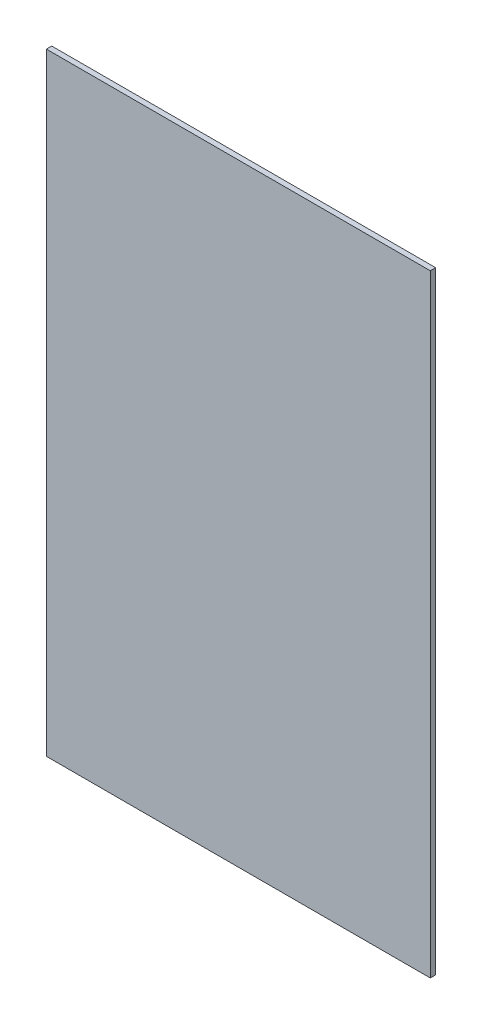
ISO-10303-21;
HEADER;
FILE_DESCRIPTION(('STEP AP214'),'2;1');
FILE_NAME('part.step','',(''),(''),'','','');
FILE_SCHEMA(('AUTOMOTIVE_DESIGN { 1 0 10303 214 1 1 1 1 }'));
ENDSEC;
DATA;
#1=APPLICATION_CONTEXT('core data for automotive mechanical design processes');
#2=APPLICATION_PROTOCOL_DEFINITION('international standard','automotive_design',2000,#1);
#3=PRODUCT_CONTEXT('',#1,'mechanical');
#4=PRODUCT('Part','Part','',(#3));
#5=PRODUCT_RELATED_PRODUCT_CATEGORY('part','',(#4));
#6=PRODUCT_DEFINITION_FORMATION('','',#4);
#7=PRODUCT_DEFINITION_CONTEXT('part definition',#1,'design');
#8=PRODUCT_DEFINITION('design','',#6,#7);
#9=PRODUCT_DEFINITION_SHAPE('','',#8);
#10=(LENGTH_UNIT() NAMED_UNIT(*) SI_UNIT(.MILLI.,.METRE.));
#11=(NAMED_UNIT(*) PLANE_ANGLE_UNIT() SI_UNIT($,.RADIAN.));
#12=(NAMED_UNIT(*) SI_UNIT($,.STERADIAN.) SOLID_ANGLE_UNIT());
#13=UNCERTAINTY_MEASURE_WITH_UNIT(LENGTH_MEASURE(1.E-05),#10,'distance_accuracy_value','');
#14=(GEOMETRIC_REPRESENTATION_CONTEXT(3) GLOBAL_UNCERTAINTY_ASSIGNED_CONTEXT((#13)) GLOBAL_UNIT_ASSIGNED_CONTEXT((#10,
#11,#12)) REPRESENTATION_CONTEXT('',''));
#15=CARTESIAN_POINT('',(0.,0.,0.));
#16=DIRECTION('',(0.,0.,1.));
#17=DIRECTION('',(1.,0.,0.));
#18=AXIS2_PLACEMENT_3D('',#15,#16,#17);
#19=CARTESIAN_POINT('',(107.5,330.,-125.5));
#20=DIRECTION('',(-1.,0.,0.));
#21=DIRECTION('',(0.,0.,1.));
#22=AXIS2_PLACEMENT_3D('',#19,#20,#21);
#23=PLANE('',#22);
#24=DIRECTION('',(0.,-1.,0.));
#25=VECTOR('',#24,1.);
#26=CARTESIAN_POINT('',(107.5,330.,-122.5));
#27=LINE('',#26,#25);
#28=CARTESIAN_POINT('',(107.5,330.,-122.5));
#29=VERTEX_POINT('',#28);
#30=CARTESIAN_POINT('',(107.5,-13.,-122.5));
#31=VERTEX_POINT('',#30);
#32=EDGE_CURVE('E100',#29,#31,#27,.T.);
#33=ORIENTED_EDGE('',*,*,#32,.T.);
#34=DIRECTION('',(0.,0.,1.));
#35=VECTOR('',#34,1.);
#36=CARTESIAN_POINT('',(107.5,-13.,-125.5));
#37=LINE('',#36,#35);
#38=CARTESIAN_POINT('',(107.5,-13.,-125.5));
#39=VERTEX_POINT('',#38);
#40=EDGE_CURVE('E11',#39,#31,#37,.T.);
#41=ORIENTED_EDGE('',*,*,#40,.F.);
#42=DIRECTION('',(0.,-1.,0.));
#43=VECTOR('',#42,1.);
#44=CARTESIAN_POINT('',(107.5,330.,-125.5));
#45=LINE('',#44,#43);
#46=CARTESIAN_POINT('',(107.5,330.,-125.5));
#47=VERTEX_POINT('',#46);
#48=EDGE_CURVE('E88',#47,#39,#45,.T.);
#49=ORIENTED_EDGE('',*,*,#48,.F.);
#50=DIRECTION('',(0.,0.,1.));
#51=VECTOR('',#50,1.);
#52=CARTESIAN_POINT('',(107.5,330.,-125.5));
#53=LINE('',#52,#51);
#54=EDGE_CURVE('E96',#47,#29,#53,.T.);
#55=ORIENTED_EDGE('',*,*,#54,.T.);
#56=EDGE_LOOP('',(#33,#41,#49,#55));
#57=FACE_BOUND('',#56,.T.);
#58=ADVANCED_FACE('F37',(#57),#23,.F.);
#59=CARTESIAN_POINT('',(107.5,-13.,-125.5));
#60=DIRECTION('',(0.,1.,0.));
#61=DIRECTION('',(0.,0.,1.));
#62=AXIS2_PLACEMENT_3D('',#59,#60,#61);
#63=PLANE('',#62);
#64=DIRECTION('',(-1.,0.,0.));
#65=VECTOR('',#64,1.);
#66=CARTESIAN_POINT('',(107.5,-13.,-122.5));
#67=LINE('',#66,#65);
#68=CARTESIAN_POINT('',(-107.5,-13.,-122.500000000002));
#69=VERTEX_POINT('',#68);
#70=EDGE_CURVE('E92',#31,#69,#67,.T.);
#71=ORIENTED_EDGE('',*,*,#70,.T.);
#72=DIRECTION('',(0.,0.,1.));
#73=VECTOR('',#72,1.);
#74=CARTESIAN_POINT('',(-107.5,-13.,-125.500000000002));
#75=LINE('',#74,#73);
#76=CARTESIAN_POINT('',(-107.5,-13.,-125.500000000002));
#77=VERTEX_POINT('',#76);
#78=EDGE_CURVE('E45',#77,#69,#75,.T.);
#79=ORIENTED_EDGE('',*,*,#78,.F.);
#80=DIRECTION('',(-1.,0.,0.));
#81=VECTOR('',#80,1.);
#82=CARTESIAN_POINT('',(107.5,-13.,-125.5));
#83=LINE('',#82,#81);
#84=EDGE_CURVE('E83',#39,#77,#83,.T.);
#85=ORIENTED_EDGE('',*,*,#84,.F.);
#86=ORIENTED_EDGE('',*,*,#40,.T.);
#87=EDGE_LOOP('',(#71,#79,#85,#86));
#88=FACE_BOUND('',#87,.T.);
#89=ADVANCED_FACE('F91',(#88),#63,.F.);
#90=CARTESIAN_POINT('',(-107.5,330.,-125.500000000002));
#91=DIRECTION('',(1.,0.,0.));
#92=DIRECTION('',(0.,0.,-1.));
#93=AXIS2_PLACEMENT_3D('',#90,#91,#92);
#94=PLANE('',#93);
#95=DIRECTION('',(0.,1.,0.));
#96=VECTOR('',#95,1.);
#97=CARTESIAN_POINT('',(-107.5,330.,-122.500000000002));
#98=LINE('',#97,#96);
#99=CARTESIAN_POINT('',(-107.5,330.,-122.500000000002));
#100=VERTEX_POINT('',#99);
#101=EDGE_CURVE('E70',#69,#100,#98,.T.);
#102=ORIENTED_EDGE('',*,*,#101,.T.);
#103=DIRECTION('',(0.,0.,1.));
#104=VECTOR('',#103,1.);
#105=CARTESIAN_POINT('',(-107.5,330.,-125.500000000002));
#106=LINE('',#105,#104);
#107=CARTESIAN_POINT('',(-107.5,330.,-125.500000000002));
#108=VERTEX_POINT('',#107);
#109=EDGE_CURVE('E93',#108,#100,#106,.T.);
#110=ORIENTED_EDGE('',*,*,#109,.F.);
#111=DIRECTION('',(0.,1.,0.));
#112=VECTOR('',#111,1.);
#113=CARTESIAN_POINT('',(-107.5,330.,-125.500000000002));
#114=LINE('',#113,#112);
#115=EDGE_CURVE('E86',#77,#108,#114,.T.);
#116=ORIENTED_EDGE('',*,*,#115,.F.);
#117=ORIENTED_EDGE('',*,*,#78,.T.);
#118=EDGE_LOOP('',(#102,#110,#116,#117));
#119=FACE_BOUND('',#118,.T.);
#120=ADVANCED_FACE('F94',(#119),#94,.F.);
#121=CARTESIAN_POINT('',(107.5,330.,-125.5));
#122=DIRECTION('',(0.,-1.,0.));
#123=DIRECTION('',(0.,0.,-1.));
#124=AXIS2_PLACEMENT_3D('',#121,#122,#123);
#125=PLANE('',#124);
#126=DIRECTION('',(1.,0.,0.));
#127=VECTOR('',#126,1.);
#128=CARTESIAN_POINT('',(107.5,330.,-122.5));
#129=LINE('',#128,#127);
#130=EDGE_CURVE('E76',#100,#29,#129,.T.);
#131=ORIENTED_EDGE('',*,*,#130,.T.);
#132=ORIENTED_EDGE('',*,*,#54,.F.);
#133=DIRECTION('',(1.,0.,0.));
#134=VECTOR('',#133,1.);
#135=CARTESIAN_POINT('',(107.5,330.,-125.5));
#136=LINE('',#135,#134);
#137=EDGE_CURVE('E53',#108,#47,#136,.T.);
#138=ORIENTED_EDGE('',*,*,#137,.F.);
#139=ORIENTED_EDGE('',*,*,#109,.T.);
#140=EDGE_LOOP('',(#131,#132,#138,#139));
#141=FACE_BOUND('',#140,.T.);
#142=ADVANCED_FACE('F107',(#141),#125,.F.);
#143=CARTESIAN_POINT('',(1.29618147673363E-12,0.,-125.500000000001));
#144=DIRECTION('',(0.,0.,-1.));
#145=DIRECTION('',(-1.,0.,0.));
#146=AXIS2_PLACEMENT_3D('',#143,#144,#145);
#147=PLANE('',#146);
#148=ORIENTED_EDGE('',*,*,#48,.T.);
#149=ORIENTED_EDGE('',*,*,#84,.T.);
#150=ORIENTED_EDGE('',*,*,#115,.T.);
#151=ORIENTED_EDGE('',*,*,#137,.T.);
#152=EDGE_LOOP('',(#148,#149,#150,#151));
#153=FACE_BOUND('',#152,.T.);
#154=ADVANCED_FACE('F84',(#153),#147,.T.);
#155=CARTESIAN_POINT('',(1.26513786527054E-12,0.,-122.500000000001));
#156=DIRECTION('',(0.,0.,-1.));
#157=DIRECTION('',(-1.,0.,0.));
#158=AXIS2_PLACEMENT_3D('',#155,#156,#157);
#159=PLANE('',#158);
#160=ORIENTED_EDGE('',*,*,#32,.F.);
#161=ORIENTED_EDGE('',*,*,#130,.F.);
#162=ORIENTED_EDGE('',*,*,#101,.F.);
#163=ORIENTED_EDGE('',*,*,#70,.F.);
#164=EDGE_LOOP('',(#160,#161,#162,#163));
#165=FACE_BOUND('',#164,.T.);
#166=ADVANCED_FACE('F110',(#165),#159,.F.);
#167=CLOSED_SHELL('',(#58,#89,#120,#142,#154,#166));
#168=MANIFOLD_SOLID_BREP('B2',#167);
#169=ADVANCED_BREP_SHAPE_REPRESENTATION('',(#18,#168),#14);
#170=SHAPE_DEFINITION_REPRESENTATION(#9,#169);
ENDSEC;
END-ISO-10303-21;
